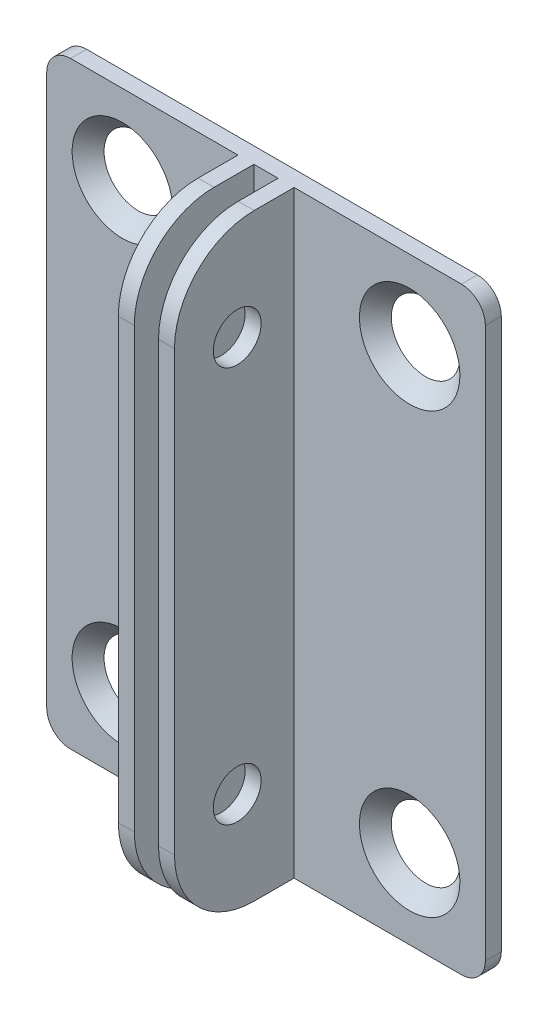
ISO-10303-21;
HEADER;
FILE_DESCRIPTION(('STEP AP214'),'2;1');
FILE_NAME('part.step','',(''),(''),'','','');
FILE_SCHEMA(('AUTOMOTIVE_DESIGN { 1 0 10303 214 1 1 1 1 }'));
ENDSEC;
DATA;
#1=APPLICATION_CONTEXT('core data for automotive mechanical design processes');
#2=APPLICATION_PROTOCOL_DEFINITION('international standard','automotive_design',2000,#1);
#3=PRODUCT_CONTEXT('',#1,'mechanical');
#4=PRODUCT('Part','Part','',(#3));
#5=PRODUCT_RELATED_PRODUCT_CATEGORY('part','',(#4));
#6=PRODUCT_DEFINITION_FORMATION('','',#4);
#7=PRODUCT_DEFINITION_CONTEXT('part definition',#1,'design');
#8=PRODUCT_DEFINITION('design','',#6,#7);
#9=PRODUCT_DEFINITION_SHAPE('','',#8);
#10=(LENGTH_UNIT() NAMED_UNIT(*) SI_UNIT(.MILLI.,.METRE.));
#11=(NAMED_UNIT(*) PLANE_ANGLE_UNIT() SI_UNIT($,.RADIAN.));
#12=(NAMED_UNIT(*) SI_UNIT($,.STERADIAN.) SOLID_ANGLE_UNIT());
#13=UNCERTAINTY_MEASURE_WITH_UNIT(LENGTH_MEASURE(1.E-05),#10,'distance_accuracy_value','');
#14=(GEOMETRIC_REPRESENTATION_CONTEXT(3) GLOBAL_UNCERTAINTY_ASSIGNED_CONTEXT((#13)) GLOBAL_UNIT_ASSIGNED_CONTEXT((#10,
#11,#12)) REPRESENTATION_CONTEXT('',''));
#15=CARTESIAN_POINT('',(0.,0.,0.));
#16=DIRECTION('',(0.,0.,1.));
#17=DIRECTION('',(1.,0.,0.));
#18=AXIS2_PLACEMENT_3D('',#15,#16,#17);
#19=CARTESIAN_POINT('',(0.,0.,0.));
#20=DIRECTION('',(0.,0.,-1.));
#21=DIRECTION('',(-1.,0.,0.));
#22=AXIS2_PLACEMENT_3D('',#19,#20,#21);
#23=PLANE('',#22);
#24=CARTESIAN_POINT('',(9.48839374827515,65.,0.));
#25=DIRECTION('',(0.,0.,-1.));
#26=DIRECTION('',(-1.,0.,0.));
#27=AXIS2_PLACEMENT_3D('',#24,#25,#26);
#28=CIRCLE('',#27,4.3);
#29=CARTESIAN_POINT('',(5.18839374827515,65.,0.));
#30=VERTEX_POINT('',#29);
#31=EDGE_CURVE('E287',#30,#30,#28,.T.);
#32=ORIENTED_EDGE('',*,*,#31,.F.);
#33=EDGE_LOOP('',(#32));
#34=FACE_BOUND('',#33,.T.);
#35=CARTESIAN_POINT('',(45.5116062517248,10.,0.));
#36=DIRECTION('',(0.,0.,-1.));
#37=DIRECTION('',(-1.,0.,0.));
#38=AXIS2_PLACEMENT_3D('',#35,#36,#37);
#39=CIRCLE('',#38,4.3);
#40=CARTESIAN_POINT('',(41.2116062517248,10.,0.));
#41=VERTEX_POINT('',#40);
#42=EDGE_CURVE('E283',#41,#41,#39,.T.);
#43=ORIENTED_EDGE('',*,*,#42,.F.);
#44=EDGE_LOOP('',(#43));
#45=FACE_BOUND('',#44,.T.);
#46=CARTESIAN_POINT('',(45.5116062517248,65.,0.));
#47=DIRECTION('',(0.,0.,-1.));
#48=DIRECTION('',(-1.,0.,0.));
#49=AXIS2_PLACEMENT_3D('',#46,#47,#48);
#50=CIRCLE('',#49,4.3);
#51=CARTESIAN_POINT('',(41.2116062517248,65.,0.));
#52=VERTEX_POINT('',#51);
#53=EDGE_CURVE('E236',#52,#52,#50,.T.);
#54=ORIENTED_EDGE('',*,*,#53,.F.);
#55=EDGE_LOOP('',(#54));
#56=FACE_BOUND('',#55,.T.);
#57=DIRECTION('',(0.,1.,0.));
#58=VECTOR('',#57,1.);
#59=CARTESIAN_POINT('',(55.,0.,0.));
#60=LINE('',#59,#58);
#61=CARTESIAN_POINT('',(55.,3.,0.));
#62=VERTEX_POINT('',#61);
#63=CARTESIAN_POINT('',(55.,72.,0.));
#64=VERTEX_POINT('',#63);
#65=EDGE_CURVE('E362',#62,#64,#60,.T.);
#66=ORIENTED_EDGE('',*,*,#65,.F.);
#67=CARTESIAN_POINT('',(52.,3.,0.));
#68=DIRECTION('',(0.,0.,-1.));
#69=DIRECTION('',(-1.,0.,0.));
#70=AXIS2_PLACEMENT_3D('',#67,#68,#69);
#71=CIRCLE('',#70,3.);
#72=CARTESIAN_POINT('',(52.,0.,0.));
#73=VERTEX_POINT('',#72);
#74=EDGE_CURVE('E289',#62,#73,#71,.T.);
#75=ORIENTED_EDGE('',*,*,#74,.T.);
#76=DIRECTION('',(1.,0.,0.));
#77=VECTOR('',#76,1.);
#78=CARTESIAN_POINT('',(0.,0.,0.));
#79=LINE('',#78,#77);
#80=CARTESIAN_POINT('',(3.,0.,0.));
#81=VERTEX_POINT('',#80);
#82=EDGE_CURVE('E358',#81,#73,#79,.T.);
#83=ORIENTED_EDGE('',*,*,#82,.F.);
#84=CARTESIAN_POINT('',(3.,3.,0.));
#85=DIRECTION('',(0.,0.,-1.));
#86=DIRECTION('',(-1.,0.,0.));
#87=AXIS2_PLACEMENT_3D('',#84,#85,#86);
#88=CIRCLE('',#87,3.);
#89=CARTESIAN_POINT('',(0.,3.,0.));
#90=VERTEX_POINT('',#89);
#91=EDGE_CURVE('E371',#81,#90,#88,.T.);
#92=ORIENTED_EDGE('',*,*,#91,.T.);
#93=DIRECTION('',(0.,-1.,0.));
#94=VECTOR('',#93,1.);
#95=CARTESIAN_POINT('',(0.,0.,0.));
#96=LINE('',#95,#94);
#97=CARTESIAN_POINT('',(0.,72.,0.));
#98=VERTEX_POINT('',#97);
#99=EDGE_CURVE('E228',#98,#90,#96,.T.);
#100=ORIENTED_EDGE('',*,*,#99,.F.);
#101=CARTESIAN_POINT('',(3.,72.,0.));
#102=DIRECTION('',(0.,0.,-1.));
#103=DIRECTION('',(-1.,0.,0.));
#104=AXIS2_PLACEMENT_3D('',#101,#102,#103);
#105=CIRCLE('',#104,3.);
#106=CARTESIAN_POINT('',(3.,75.,0.));
#107=VERTEX_POINT('',#106);
#108=EDGE_CURVE('E369',#98,#107,#105,.T.);
#109=ORIENTED_EDGE('',*,*,#108,.T.);
#110=DIRECTION('',(-1.,0.,0.));
#111=VECTOR('',#110,1.);
#112=CARTESIAN_POINT('',(0.,75.,0.));
#113=LINE('',#112,#111);
#114=CARTESIAN_POINT('',(52.,75.,0.));
#115=VERTEX_POINT('',#114);
#116=EDGE_CURVE('E214',#115,#107,#113,.T.);
#117=ORIENTED_EDGE('',*,*,#116,.F.);
#118=CARTESIAN_POINT('',(52.,72.,0.));
#119=DIRECTION('',(0.,0.,-1.));
#120=DIRECTION('',(-1.,0.,0.));
#121=AXIS2_PLACEMENT_3D('',#118,#119,#120);
#122=CIRCLE('',#121,3.);
#123=EDGE_CURVE('E213',#115,#64,#122,.T.);
#124=ORIENTED_EDGE('',*,*,#123,.T.);
#125=EDGE_LOOP('',(#66,#75,#83,#92,#100,#109,#117,#124));
#126=FACE_BOUND('',#125,.T.);
#127=CARTESIAN_POINT('',(9.48839374827515,9.99999999999999,0.));
#128=DIRECTION('',(0.,0.,-1.));
#129=DIRECTION('',(-1.,0.,0.));
#130=AXIS2_PLACEMENT_3D('',#127,#128,#129);
#131=CIRCLE('',#130,4.3);
#132=CARTESIAN_POINT('',(5.18839374827515,9.99999999999999,0.));
#133=VERTEX_POINT('',#132);
#134=EDGE_CURVE('E43',#133,#133,#131,.T.);
#135=ORIENTED_EDGE('',*,*,#134,.F.);
#136=EDGE_LOOP('',(#135));
#137=FACE_BOUND('',#136,.T.);
#138=ADVANCED_FACE('F34',(#34,#45,#56,#126,#137),#23,.T.);
#139=CARTESIAN_POINT('',(0.,0.,2.));
#140=DIRECTION('',(0.,0.,-1.));
#141=DIRECTION('',(-1.,0.,0.));
#142=AXIS2_PLACEMENT_3D('',#139,#140,#141);
#143=PLANE('',#142);
#144=CARTESIAN_POINT('',(9.48839374827515,9.99999999999999,2.));
#145=DIRECTION('',(0.,0.,1.));
#146=DIRECTION('',(1.,0.,0.));
#147=AXIS2_PLACEMENT_3D('',#144,#145,#146);
#148=CIRCLE('',#147,6.3);
#149=CARTESIAN_POINT('',(15.7883937482752,9.99999999999999,2.));
#150=VERTEX_POINT('',#149);
#151=EDGE_CURVE('E11',#150,#150,#148,.T.);
#152=ORIENTED_EDGE('',*,*,#151,.F.);
#153=EDGE_LOOP('',(#152));
#154=FACE_BOUND('',#153,.T.);
#155=DIRECTION('',(0.,-1.,0.));
#156=VECTOR('',#155,1.);
#157=CARTESIAN_POINT('',(0.,0.,2.));
#158=LINE('',#157,#156);
#159=CARTESIAN_POINT('',(0.,72.,2.));
#160=VERTEX_POINT('',#159);
#161=CARTESIAN_POINT('',(0.,3.,2.));
#162=VERTEX_POINT('',#161);
#163=EDGE_CURVE('E208',#160,#162,#158,.T.);
#164=ORIENTED_EDGE('',*,*,#163,.T.);
#165=CARTESIAN_POINT('',(3.,3.,2.));
#166=DIRECTION('',(0.,0.,-1.));
#167=DIRECTION('',(-1.,0.,0.));
#168=AXIS2_PLACEMENT_3D('',#165,#166,#167);
#169=CIRCLE('',#168,3.);
#170=CARTESIAN_POINT('',(3.,0.,2.));
#171=VERTEX_POINT('',#170);
#172=EDGE_CURVE('E181',#162,#171,#169,.F.);
#173=ORIENTED_EDGE('',*,*,#172,.T.);
#174=DIRECTION('',(1.,0.,0.));
#175=VECTOR('',#174,1.);
#176=CARTESIAN_POINT('',(0.,0.,2.));
#177=LINE('',#176,#175);
#178=CARTESIAN_POINT('',(23.9815017817718,0.,2.));
#179=VERTEX_POINT('',#178);
#180=EDGE_CURVE('E232',#171,#179,#177,.T.);
#181=ORIENTED_EDGE('',*,*,#180,.T.);
#182=DIRECTION('',(0.,-1.,0.));
#183=VECTOR('',#182,1.);
#184=CARTESIAN_POINT('',(23.9815017817718,0.,2.));
#185=LINE('',#184,#183);
#186=CARTESIAN_POINT('',(23.9815017817718,75.,2.));
#187=VERTEX_POINT('',#186);
#188=EDGE_CURVE('E271',#187,#179,#185,.T.);
#189=ORIENTED_EDGE('',*,*,#188,.F.);
#190=DIRECTION('',(-1.,0.,0.));
#191=VECTOR('',#190,1.);
#192=CARTESIAN_POINT('',(0.,75.,2.));
#193=LINE('',#192,#191);
#194=CARTESIAN_POINT('',(3.,75.,2.));
#195=VERTEX_POINT('',#194);
#196=EDGE_CURVE('E211',#187,#195,#193,.T.);
#197=ORIENTED_EDGE('',*,*,#196,.T.);
#198=CARTESIAN_POINT('',(3.,72.,2.));
#199=DIRECTION('',(0.,0.,-1.));
#200=DIRECTION('',(-1.,0.,0.));
#201=AXIS2_PLACEMENT_3D('',#198,#199,#200);
#202=CIRCLE('',#201,3.);
#203=EDGE_CURVE('E229',#195,#160,#202,.F.);
#204=ORIENTED_EDGE('',*,*,#203,.T.);
#205=EDGE_LOOP('',(#164,#173,#181,#189,#197,#204));
#206=FACE_BOUND('',#205,.T.);
#207=CARTESIAN_POINT('',(9.48839374827515,65.,2.));
#208=DIRECTION('',(0.,0.,1.));
#209=DIRECTION('',(1.,0.,0.));
#210=AXIS2_PLACEMENT_3D('',#207,#208,#209);
#211=CIRCLE('',#210,6.3);
#212=CARTESIAN_POINT('',(15.7883937482752,65.,2.));
#213=VERTEX_POINT('',#212);
#214=EDGE_CURVE('E290',#213,#213,#211,.T.);
#215=ORIENTED_EDGE('',*,*,#214,.F.);
#216=EDGE_LOOP('',(#215));
#217=FACE_BOUND('',#216,.T.);
#218=ADVANCED_FACE('F386',(#154,#206,#217),#143,.F.);
#219=DIRECTION('',(0.,-1.,0.));
#220=VECTOR('',#219,1.);
#221=CARTESIAN_POINT('',(29.0161196164076,0.,2.));
#222=LINE('',#221,#220);
#223=CARTESIAN_POINT('',(29.0161196164075,75.,2.));
#224=VERTEX_POINT('',#223);
#225=CARTESIAN_POINT('',(29.0161196164075,0.,2.));
#226=VERTEX_POINT('',#225);
#227=EDGE_CURVE('E248',#224,#226,#222,.T.);
#228=ORIENTED_EDGE('',*,*,#227,.F.);
#229=CARTESIAN_POINT('',(25.9838803835925,75.,2.));
#230=VERTEX_POINT('',#229);
#231=EDGE_CURVE('E210',#224,#230,#193,.T.);
#232=ORIENTED_EDGE('',*,*,#231,.T.);
#233=DIRECTION('',(0.,1.,0.));
#234=VECTOR('',#233,1.);
#235=CARTESIAN_POINT('',(25.9838803835925,0.,2.));
#236=LINE('',#235,#234);
#237=CARTESIAN_POINT('',(25.9838803835925,0.,2.));
#238=VERTEX_POINT('',#237);
#239=EDGE_CURVE('E267',#238,#230,#236,.T.);
#240=ORIENTED_EDGE('',*,*,#239,.F.);
#241=EDGE_CURVE('E353',#238,#226,#177,.T.);
#242=ORIENTED_EDGE('',*,*,#241,.T.);
#243=EDGE_LOOP('',(#228,#232,#240,#242));
#244=FACE_BOUND('',#243,.T.);
#245=ADVANCED_FACE('F458',(#244),#143,.F.);
#246=CARTESIAN_POINT('',(45.5116062517248,10.,2.));
#247=DIRECTION('',(0.,0.,1.));
#248=DIRECTION('',(1.,0.,0.));
#249=AXIS2_PLACEMENT_3D('',#246,#247,#248);
#250=CIRCLE('',#249,6.3);
#251=CARTESIAN_POINT('',(51.8116062517248,10.,2.));
#252=VERTEX_POINT('',#251);
#253=EDGE_CURVE('E285',#252,#252,#250,.T.);
#254=ORIENTED_EDGE('',*,*,#253,.F.);
#255=EDGE_LOOP('',(#254));
#256=FACE_BOUND('',#255,.T.);
#257=CARTESIAN_POINT('',(45.5116062517248,65.,2.));
#258=DIRECTION('',(0.,0.,1.));
#259=DIRECTION('',(1.,0.,0.));
#260=AXIS2_PLACEMENT_3D('',#257,#258,#259);
#261=CIRCLE('',#260,6.3);
#262=CARTESIAN_POINT('',(51.8116062517248,65.,2.));
#263=VERTEX_POINT('',#262);
#264=EDGE_CURVE('E282',#263,#263,#261,.T.);
#265=ORIENTED_EDGE('',*,*,#264,.F.);
#266=EDGE_LOOP('',(#265));
#267=FACE_BOUND('',#266,.T.);
#268=CARTESIAN_POINT('',(31.0184982182283,0.,2.));
#269=VERTEX_POINT('',#268);
#270=CARTESIAN_POINT('',(52.,0.,2.));
#271=VERTEX_POINT('',#270);
#272=EDGE_CURVE('E352',#269,#271,#177,.T.);
#273=ORIENTED_EDGE('',*,*,#272,.T.);
#274=CARTESIAN_POINT('',(52.,3.,2.));
#275=DIRECTION('',(0.,0.,-1.));
#276=DIRECTION('',(-1.,0.,0.));
#277=AXIS2_PLACEMENT_3D('',#274,#275,#276);
#278=CIRCLE('',#277,3.);
#279=CARTESIAN_POINT('',(55.,3.,2.));
#280=VERTEX_POINT('',#279);
#281=EDGE_CURVE('E354',#271,#280,#278,.F.);
#282=ORIENTED_EDGE('',*,*,#281,.T.);
#283=DIRECTION('',(0.,1.,0.));
#284=VECTOR('',#283,1.);
#285=CARTESIAN_POINT('',(55.,0.,2.));
#286=LINE('',#285,#284);
#287=CARTESIAN_POINT('',(55.,72.,2.));
#288=VERTEX_POINT('',#287);
#289=EDGE_CURVE('E196',#280,#288,#286,.T.);
#290=ORIENTED_EDGE('',*,*,#289,.T.);
#291=CARTESIAN_POINT('',(52.,72.,2.));
#292=DIRECTION('',(0.,0.,-1.));
#293=DIRECTION('',(-1.,0.,0.));
#294=AXIS2_PLACEMENT_3D('',#291,#292,#293);
#295=CIRCLE('',#294,3.);
#296=CARTESIAN_POINT('',(52.,75.,2.));
#297=VERTEX_POINT('',#296);
#298=EDGE_CURVE('E188',#288,#297,#295,.F.);
#299=ORIENTED_EDGE('',*,*,#298,.T.);
#300=CARTESIAN_POINT('',(31.0184982182283,75.,2.));
#301=VERTEX_POINT('',#300);
#302=EDGE_CURVE('E193',#297,#301,#193,.T.);
#303=ORIENTED_EDGE('',*,*,#302,.T.);
#304=DIRECTION('',(0.,1.,0.));
#305=VECTOR('',#304,1.);
#306=CARTESIAN_POINT('',(31.0184982182283,0.,2.));
#307=LINE('',#306,#305);
#308=EDGE_CURVE('E244',#269,#301,#307,.T.);
#309=ORIENTED_EDGE('',*,*,#308,.F.);
#310=EDGE_LOOP('',(#273,#282,#290,#299,#303,#309));
#311=FACE_BOUND('',#310,.T.);
#312=ADVANCED_FACE('F191',(#256,#267,#311),#143,.F.);
#313=CARTESIAN_POINT('',(0.,0.,2.));
#314=DIRECTION('',(1.,0.,0.));
#315=DIRECTION('',(0.,0.,-1.));
#316=AXIS2_PLACEMENT_3D('',#313,#314,#315);
#317=PLANE('',#316);
#318=ORIENTED_EDGE('',*,*,#99,.T.);
#319=DIRECTION('',(0.,0.,-1.));
#320=VECTOR('',#319,1.);
#321=CARTESIAN_POINT('',(0.,3.,2.));
#322=LINE('',#321,#320);
#323=EDGE_CURVE('E226',#90,#162,#322,.F.);
#324=ORIENTED_EDGE('',*,*,#323,.T.);
#325=ORIENTED_EDGE('',*,*,#163,.F.);
#326=DIRECTION('',(0.,0.,-1.));
#327=VECTOR('',#326,1.);
#328=CARTESIAN_POINT('',(0.,72.,2.));
#329=LINE('',#328,#327);
#330=EDGE_CURVE('E222',#160,#98,#329,.T.);
#331=ORIENTED_EDGE('',*,*,#330,.T.);
#332=EDGE_LOOP('',(#318,#324,#325,#331));
#333=FACE_BOUND('',#332,.T.);
#334=ADVANCED_FACE('F394',(#333),#317,.F.);
#335=CARTESIAN_POINT('',(0.,0.,2.));
#336=DIRECTION('',(0.,1.,0.));
#337=DIRECTION('',(0.,0.,1.));
#338=AXIS2_PLACEMENT_3D('',#335,#336,#337);
#339=PLANE('',#338);
#340=DIRECTION('',(0.,0.,-1.));
#341=VECTOR('',#340,1.);
#342=CARTESIAN_POINT('',(31.0184982182283,0.,17.));
#343=LINE('',#342,#341);
#344=CARTESIAN_POINT('',(31.0184982182283,0.,7.));
#345=VERTEX_POINT('',#344);
#346=EDGE_CURVE('E247',#345,#269,#343,.T.);
#347=ORIENTED_EDGE('',*,*,#346,.F.);
#348=DIRECTION('',(1.,0.,0.));
#349=VECTOR('',#348,1.);
#350=CARTESIAN_POINT('',(0.,0.,7.));
#351=LINE('',#350,#349);
#352=CARTESIAN_POINT('',(29.0161196164076,0.,7.));
#353=VERTEX_POINT('',#352);
#354=EDGE_CURVE('E225',#345,#353,#351,.F.);
#355=ORIENTED_EDGE('',*,*,#354,.T.);
#356=DIRECTION('',(0.,0.,-1.));
#357=VECTOR('',#356,1.);
#358=CARTESIAN_POINT('',(29.0161196164076,0.,17.));
#359=LINE('',#358,#357);
#360=EDGE_CURVE('E142',#353,#226,#359,.T.);
#361=ORIENTED_EDGE('',*,*,#360,.T.);
#362=ORIENTED_EDGE('',*,*,#241,.F.);
#363=DIRECTION('',(0.,0.,-1.));
#364=VECTOR('',#363,1.);
#365=CARTESIAN_POINT('',(25.9838803835925,0.,17.));
#366=LINE('',#365,#364);
#367=CARTESIAN_POINT('',(25.9838803835925,0.,7.));
#368=VERTEX_POINT('',#367);
#369=EDGE_CURVE('E270',#368,#238,#366,.T.);
#370=ORIENTED_EDGE('',*,*,#369,.F.);
#371=DIRECTION('',(1.,0.,0.));
#372=VECTOR('',#371,1.);
#373=CARTESIAN_POINT('',(0.,0.,7.));
#374=LINE('',#373,#372);
#375=CARTESIAN_POINT('',(23.9815017817718,0.,7.));
#376=VERTEX_POINT('',#375);
#377=EDGE_CURVE('E134',#368,#376,#374,.F.);
#378=ORIENTED_EDGE('',*,*,#377,.T.);
#379=DIRECTION('',(0.,0.,-1.));
#380=VECTOR('',#379,1.);
#381=CARTESIAN_POINT('',(23.9815017817718,0.,17.));
#382=LINE('',#381,#380);
#383=EDGE_CURVE('E250',#376,#179,#382,.T.);
#384=ORIENTED_EDGE('',*,*,#383,.T.);
#385=ORIENTED_EDGE('',*,*,#180,.F.);
#386=DIRECTION('',(0.,0.,-1.));
#387=VECTOR('',#386,1.);
#388=CARTESIAN_POINT('',(3.,0.,2.));
#389=LINE('',#388,#387);
#390=EDGE_CURVE('E347',#171,#81,#389,.T.);
#391=ORIENTED_EDGE('',*,*,#390,.T.);
#392=ORIENTED_EDGE('',*,*,#82,.T.);
#393=DIRECTION('',(0.,0.,-1.));
#394=VECTOR('',#393,1.);
#395=CARTESIAN_POINT('',(52.,0.,2.));
#396=LINE('',#395,#394);
#397=EDGE_CURVE('E361',#73,#271,#396,.F.);
#398=ORIENTED_EDGE('',*,*,#397,.T.);
#399=ORIENTED_EDGE('',*,*,#272,.F.);
#400=EDGE_LOOP('',(#347,#355,#361,#362,#370,#378,#384,#385,#391,#392,#398,#399));
#401=FACE_BOUND('',#400,.T.);
#402=ADVANCED_FACE('F404',(#401),#339,.F.);
#403=CARTESIAN_POINT('',(55.,0.,2.));
#404=DIRECTION('',(-1.,0.,0.));
#405=DIRECTION('',(0.,0.,1.));
#406=AXIS2_PLACEMENT_3D('',#403,#404,#405);
#407=PLANE('',#406);
#408=ORIENTED_EDGE('',*,*,#289,.F.);
#409=DIRECTION('',(0.,0.,-1.));
#410=VECTOR('',#409,1.);
#411=CARTESIAN_POINT('',(55.,3.,2.));
#412=LINE('',#411,#410);
#413=EDGE_CURVE('E364',#280,#62,#412,.T.);
#414=ORIENTED_EDGE('',*,*,#413,.T.);
#415=ORIENTED_EDGE('',*,*,#65,.T.);
#416=DIRECTION('',(0.,0.,-1.));
#417=VECTOR('',#416,1.);
#418=CARTESIAN_POINT('',(55.,72.,2.));
#419=LINE('',#418,#417);
#420=EDGE_CURVE('E279',#64,#288,#419,.F.);
#421=ORIENTED_EDGE('',*,*,#420,.T.);
#422=EDGE_LOOP('',(#408,#414,#415,#421));
#423=FACE_BOUND('',#422,.T.);
#424=ADVANCED_FACE('F444',(#423),#407,.F.);
#425=CARTESIAN_POINT('',(0.,75.,2.));
#426=DIRECTION('',(0.,-1.,0.));
#427=DIRECTION('',(0.,0.,-1.));
#428=AXIS2_PLACEMENT_3D('',#425,#426,#427);
#429=PLANE('',#428);
#430=DIRECTION('',(0.,0.,-1.));
#431=VECTOR('',#430,1.);
#432=CARTESIAN_POINT('',(29.0161196164075,75.,17.));
#433=LINE('',#432,#431);
#434=CARTESIAN_POINT('',(29.0161196164075,75.,7.));
#435=VERTEX_POINT('',#434);
#436=EDGE_CURVE('E255',#435,#224,#433,.T.);
#437=ORIENTED_EDGE('',*,*,#436,.F.);
#438=DIRECTION('',(-1.,0.,0.));
#439=VECTOR('',#438,1.);
#440=CARTESIAN_POINT('',(0.,75.,7.));
#441=LINE('',#440,#439);
#442=CARTESIAN_POINT('',(31.0184982182282,75.,7.));
#443=VERTEX_POINT('',#442);
#444=EDGE_CURVE('E217',#435,#443,#441,.F.);
#445=ORIENTED_EDGE('',*,*,#444,.T.);
#446=DIRECTION('',(0.,0.,-1.));
#447=VECTOR('',#446,1.);
#448=CARTESIAN_POINT('',(31.0184982182282,75.,17.));
#449=LINE('',#448,#447);
#450=EDGE_CURVE('E207',#443,#301,#449,.T.);
#451=ORIENTED_EDGE('',*,*,#450,.T.);
#452=ORIENTED_EDGE('',*,*,#302,.F.);
#453=DIRECTION('',(0.,0.,-1.));
#454=VECTOR('',#453,1.);
#455=CARTESIAN_POINT('',(52.,75.,2.));
#456=LINE('',#455,#454);
#457=EDGE_CURVE('E204',#297,#115,#456,.T.);
#458=ORIENTED_EDGE('',*,*,#457,.T.);
#459=ORIENTED_EDGE('',*,*,#116,.T.);
#460=DIRECTION('',(0.,0.,-1.));
#461=VECTOR('',#460,1.);
#462=CARTESIAN_POINT('',(3.,75.,2.));
#463=LINE('',#462,#461);
#464=EDGE_CURVE('E87',#107,#195,#463,.F.);
#465=ORIENTED_EDGE('',*,*,#464,.T.);
#466=ORIENTED_EDGE('',*,*,#196,.F.);
#467=DIRECTION('',(0.,0.,-1.));
#468=VECTOR('',#467,1.);
#469=CARTESIAN_POINT('',(23.9815017817718,75.,17.));
#470=LINE('',#469,#468);
#471=CARTESIAN_POINT('',(23.9815017817718,75.,7.));
#472=VERTEX_POINT('',#471);
#473=EDGE_CURVE('E273',#472,#187,#470,.T.);
#474=ORIENTED_EDGE('',*,*,#473,.F.);
#475=DIRECTION('',(-1.,0.,0.));
#476=VECTOR('',#475,1.);
#477=CARTESIAN_POINT('',(0.,75.,7.));
#478=LINE('',#477,#476);
#479=CARTESIAN_POINT('',(25.9838803835925,75.,7.));
#480=VERTEX_POINT('',#479);
#481=EDGE_CURVE('E78',#472,#480,#478,.F.);
#482=ORIENTED_EDGE('',*,*,#481,.T.);
#483=DIRECTION('',(0.,0.,-1.));
#484=VECTOR('',#483,1.);
#485=CARTESIAN_POINT('',(25.9838803835925,75.,17.));
#486=LINE('',#485,#484);
#487=EDGE_CURVE('E276',#480,#230,#486,.T.);
#488=ORIENTED_EDGE('',*,*,#487,.T.);
#489=ORIENTED_EDGE('',*,*,#231,.F.);
#490=EDGE_LOOP('',(#437,#445,#451,#452,#458,#459,#465,#466,#474,#482,#488,#489));
#491=FACE_BOUND('',#490,.T.);
#492=ADVANCED_FACE('F203',(#491),#429,.F.);
#493=CARTESIAN_POINT('',(23.9815017817718,0.,17.));
#494=DIRECTION('',(1.,0.,0.));
#495=DIRECTION('',(0.,0.,-1.));
#496=AXIS2_PLACEMENT_3D('',#493,#494,#495);
#497=PLANE('',#496);
#498=CARTESIAN_POINT('',(23.9815017817718,62.3122140243295,9.1337107707589));
#499=DIRECTION('',(1.,0.,0.));
#500=DIRECTION('',(0.,0.,-1.));
#501=AXIS2_PLACEMENT_3D('',#498,#499,#500);
#502=CIRCLE('',#501,3.);
#503=CARTESIAN_POINT('',(23.9815017817718,62.3122140243295,6.13371077075891));
#504=VERTEX_POINT('',#503);
#505=EDGE_CURVE('E313',#504,#504,#502,.F.);
#506=ORIENTED_EDGE('',*,*,#505,.F.);
#507=EDGE_LOOP('',(#506));
#508=FACE_BOUND('',#507,.T.);
#509=CARTESIAN_POINT('',(23.9815017817718,12.6877859756705,9.13371077075888));
#510=DIRECTION('',(1.,0.,0.));
#511=DIRECTION('',(0.,0.,-1.));
#512=AXIS2_PLACEMENT_3D('',#509,#510,#511);
#513=CIRCLE('',#512,3.);
#514=CARTESIAN_POINT('',(23.9815017817718,12.6877859756705,6.13371077075888));
#515=VERTEX_POINT('',#514);
#516=EDGE_CURVE('E302',#515,#515,#513,.F.);
#517=ORIENTED_EDGE('',*,*,#516,.F.);
#518=EDGE_LOOP('',(#517));
#519=FACE_BOUND('',#518,.T.);
#520=ORIENTED_EDGE('',*,*,#383,.F.);
#521=CARTESIAN_POINT('',(23.9815017817718,10.,7.));
#522=DIRECTION('',(1.,0.,0.));
#523=DIRECTION('',(0.,0.,-1.));
#524=AXIS2_PLACEMENT_3D('',#521,#522,#523);
#525=CIRCLE('',#524,10.);
#526=CARTESIAN_POINT('',(23.9815017817718,10.,17.));
#527=VERTEX_POINT('',#526);
#528=EDGE_CURVE('E274',#376,#527,#525,.F.);
#529=ORIENTED_EDGE('',*,*,#528,.T.);
#530=DIRECTION('',(0.,-1.,0.));
#531=VECTOR('',#530,1.);
#532=CARTESIAN_POINT('',(23.9815017817718,0.,17.));
#533=LINE('',#532,#531);
#534=CARTESIAN_POINT('',(23.9815017817718,65.,17.));
#535=VERTEX_POINT('',#534);
#536=EDGE_CURVE('E264',#535,#527,#533,.T.);
#537=ORIENTED_EDGE('',*,*,#536,.F.);
#538=CARTESIAN_POINT('',(23.9815017817718,65.,7.));
#539=DIRECTION('',(1.,0.,0.));
#540=DIRECTION('',(0.,0.,-1.));
#541=AXIS2_PLACEMENT_3D('',#538,#539,#540);
#542=CIRCLE('',#541,10.);
#543=EDGE_CURVE('E52',#535,#472,#542,.F.);
#544=ORIENTED_EDGE('',*,*,#543,.T.);
#545=ORIENTED_EDGE('',*,*,#473,.T.);
#546=ORIENTED_EDGE('',*,*,#188,.T.);
#547=EDGE_LOOP('',(#520,#529,#537,#544,#545,#546));
#548=FACE_BOUND('',#547,.T.);
#549=ADVANCED_FACE('F407',(#508,#519,#548),#497,.F.);
#550=CARTESIAN_POINT('',(25.9838803835925,0.,17.));
#551=DIRECTION('',(-1.,0.,0.));
#552=DIRECTION('',(0.,0.,1.));
#553=AXIS2_PLACEMENT_3D('',#550,#551,#552);
#554=PLANE('',#553);
#555=CARTESIAN_POINT('',(25.9838803835925,62.3122140243295,9.1337107707589));
#556=DIRECTION('',(-1.,0.,0.));
#557=DIRECTION('',(0.,0.,1.));
#558=AXIS2_PLACEMENT_3D('',#555,#556,#557);
#559=CIRCLE('',#558,3.);
#560=CARTESIAN_POINT('',(25.9838803835925,62.3122140243295,12.1337107707589));
#561=VERTEX_POINT('',#560);
#562=EDGE_CURVE('E310',#561,#561,#559,.F.);
#563=ORIENTED_EDGE('',*,*,#562,.F.);
#564=EDGE_LOOP('',(#563));
#565=FACE_BOUND('',#564,.T.);
#566=CARTESIAN_POINT('',(25.9838803835925,12.6877859756705,9.13371077075888));
#567=DIRECTION('',(-1.,0.,0.));
#568=DIRECTION('',(0.,0.,1.));
#569=AXIS2_PLACEMENT_3D('',#566,#567,#568);
#570=CIRCLE('',#569,3.);
#571=CARTESIAN_POINT('',(25.9838803835925,12.6877859756705,12.1337107707589));
#572=VERTEX_POINT('',#571);
#573=EDGE_CURVE('E297',#572,#572,#570,.F.);
#574=ORIENTED_EDGE('',*,*,#573,.F.);
#575=EDGE_LOOP('',(#574));
#576=FACE_BOUND('',#575,.T.);
#577=DIRECTION('',(0.,1.,0.));
#578=VECTOR('',#577,1.);
#579=CARTESIAN_POINT('',(25.9838803835925,0.,17.));
#580=LINE('',#579,#578);
#581=CARTESIAN_POINT('',(25.9838803835925,10.,17.));
#582=VERTEX_POINT('',#581);
#583=CARTESIAN_POINT('',(25.9838803835925,65.,17.));
#584=VERTEX_POINT('',#583);
#585=EDGE_CURVE('E260',#582,#584,#580,.T.);
#586=ORIENTED_EDGE('',*,*,#585,.F.);
#587=CARTESIAN_POINT('',(25.9838803835925,10.,7.));
#588=DIRECTION('',(-1.,0.,0.));
#589=DIRECTION('',(0.,0.,1.));
#590=AXIS2_PLACEMENT_3D('',#587,#588,#589);
#591=CIRCLE('',#590,10.);
#592=EDGE_CURVE('E268',#582,#368,#591,.F.);
#593=ORIENTED_EDGE('',*,*,#592,.T.);
#594=ORIENTED_EDGE('',*,*,#369,.T.);
#595=ORIENTED_EDGE('',*,*,#239,.T.);
#596=ORIENTED_EDGE('',*,*,#487,.F.);
#597=CARTESIAN_POINT('',(25.9838803835925,65.,7.));
#598=DIRECTION('',(-1.,0.,0.));
#599=DIRECTION('',(0.,0.,1.));
#600=AXIS2_PLACEMENT_3D('',#597,#598,#599);
#601=CIRCLE('',#600,10.);
#602=EDGE_CURVE('E265',#480,#584,#601,.F.);
#603=ORIENTED_EDGE('',*,*,#602,.T.);
#604=EDGE_LOOP('',(#586,#593,#594,#595,#596,#603));
#605=FACE_BOUND('',#604,.T.);
#606=ADVANCED_FACE('F414',(#565,#576,#605),#554,.F.);
#607=CARTESIAN_POINT('',(0.,0.,17.));
#608=DIRECTION('',(0.,0.,-1.));
#609=DIRECTION('',(-1.,0.,0.));
#610=AXIS2_PLACEMENT_3D('',#607,#608,#609);
#611=PLANE('',#610);
#612=ORIENTED_EDGE('',*,*,#536,.T.);
#613=DIRECTION('',(1.,0.,0.));
#614=VECTOR('',#613,1.);
#615=CARTESIAN_POINT('',(0.,10.,17.));
#616=LINE('',#615,#614);
#617=EDGE_CURVE('E261',#527,#582,#616,.T.);
#618=ORIENTED_EDGE('',*,*,#617,.T.);
#619=ORIENTED_EDGE('',*,*,#585,.T.);
#620=DIRECTION('',(-1.,0.,0.));
#621=VECTOR('',#620,1.);
#622=CARTESIAN_POINT('',(0.,65.,17.));
#623=LINE('',#622,#621);
#624=EDGE_CURVE('E258',#584,#535,#623,.T.);
#625=ORIENTED_EDGE('',*,*,#624,.T.);
#626=EDGE_LOOP('',(#612,#618,#619,#625));
#627=FACE_BOUND('',#626,.T.);
#628=ADVANCED_FACE('F416',(#627),#611,.F.);
#629=CARTESIAN_POINT('',(29.0161196164076,0.,17.));
#630=DIRECTION('',(1.,0.,0.));
#631=DIRECTION('',(0.,1.,0.));
#632=AXIS2_PLACEMENT_3D('',#629,#630,#631);
#633=PLANE('',#632);
#634=CARTESIAN_POINT('',(29.0161196164075,62.3122140243295,9.1337107707589));
#635=DIRECTION('',(1.,0.,0.));
#636=DIRECTION('',(0.,1.,0.));
#637=AXIS2_PLACEMENT_3D('',#634,#635,#636);
#638=CIRCLE('',#637,3.);
#639=CARTESIAN_POINT('',(29.0161196164075,65.3122140243295,9.1337107707589));
#640=VERTEX_POINT('',#639);
#641=EDGE_CURVE('E307',#640,#640,#638,.F.);
#642=ORIENTED_EDGE('',*,*,#641,.F.);
#643=EDGE_LOOP('',(#642));
#644=FACE_BOUND('',#643,.T.);
#645=CARTESIAN_POINT('',(29.0161196164076,12.6877859756705,9.13371077075888));
#646=DIRECTION('',(1.,0.,0.));
#647=DIRECTION('',(0.,1.,0.));
#648=AXIS2_PLACEMENT_3D('',#645,#646,#647);
#649=CIRCLE('',#648,3.);
#650=CARTESIAN_POINT('',(29.0161196164076,15.6877859756705,9.13371077075888));
#651=VERTEX_POINT('',#650);
#652=EDGE_CURVE('E293',#651,#651,#649,.F.);
#653=ORIENTED_EDGE('',*,*,#652,.F.);
#654=EDGE_LOOP('',(#653));
#655=FACE_BOUND('',#654,.T.);
#656=ORIENTED_EDGE('',*,*,#360,.F.);
#657=CARTESIAN_POINT('',(29.0161196164076,10.,7.));
#658=DIRECTION('',(1.,0.,0.));
#659=DIRECTION('',(0.,1.,0.));
#660=AXIS2_PLACEMENT_3D('',#657,#658,#659);
#661=CIRCLE('',#660,10.);
#662=CARTESIAN_POINT('',(29.0161196164076,10.,17.));
#663=VERTEX_POINT('',#662);
#664=EDGE_CURVE('E256',#353,#663,#661,.F.);
#665=ORIENTED_EDGE('',*,*,#664,.T.);
#666=DIRECTION('',(0.,-1.,0.));
#667=VECTOR('',#666,1.);
#668=CARTESIAN_POINT('',(29.0161196164076,0.,17.));
#669=LINE('',#668,#667);
#670=CARTESIAN_POINT('',(29.0161196164075,65.,17.));
#671=VERTEX_POINT('',#670);
#672=EDGE_CURVE('E241',#671,#663,#669,.T.);
#673=ORIENTED_EDGE('',*,*,#672,.F.);
#674=CARTESIAN_POINT('',(29.0161196164075,65.,7.));
#675=DIRECTION('',(1.,0.,0.));
#676=DIRECTION('',(0.,1.,0.));
#677=AXIS2_PLACEMENT_3D('',#674,#675,#676);
#678=CIRCLE('',#677,10.);
#679=EDGE_CURVE('E252',#671,#435,#678,.F.);
#680=ORIENTED_EDGE('',*,*,#679,.T.);
#681=ORIENTED_EDGE('',*,*,#436,.T.);
#682=ORIENTED_EDGE('',*,*,#227,.T.);
#683=EDGE_LOOP('',(#656,#665,#673,#680,#681,#682));
#684=FACE_BOUND('',#683,.T.);
#685=ADVANCED_FACE('F424',(#644,#655,#684),#633,.F.);
#686=CARTESIAN_POINT('',(31.0184982182283,0.,17.));
#687=DIRECTION('',(-1.,0.,0.));
#688=DIRECTION('',(0.,-1.,0.));
#689=AXIS2_PLACEMENT_3D('',#686,#687,#688);
#690=PLANE('',#689);
#691=CARTESIAN_POINT('',(31.0184982182282,62.3122140243295,9.1337107707589));
#692=DIRECTION('',(-1.,0.,0.));
#693=DIRECTION('',(0.,-1.,0.));
#694=AXIS2_PLACEMENT_3D('',#691,#692,#693);
#695=CIRCLE('',#694,3.);
#696=CARTESIAN_POINT('',(31.0184982182282,59.3122140243295,9.1337107707589));
#697=VERTEX_POINT('',#696);
#698=EDGE_CURVE('E37',#697,#697,#695,.F.);
#699=ORIENTED_EDGE('',*,*,#698,.F.);
#700=EDGE_LOOP('',(#699));
#701=FACE_BOUND('',#700,.T.);
#702=CARTESIAN_POINT('',(31.0184982182283,12.6877859756705,9.13371077075888));
#703=DIRECTION('',(-1.,0.,0.));
#704=DIRECTION('',(0.,-1.,0.));
#705=AXIS2_PLACEMENT_3D('',#702,#703,#704);
#706=CIRCLE('',#705,3.);
#707=CARTESIAN_POINT('',(31.0184982182283,9.68778597567051,9.13371077075888));
#708=VERTEX_POINT('',#707);
#709=EDGE_CURVE('E291',#708,#708,#706,.F.);
#710=ORIENTED_EDGE('',*,*,#709,.F.);
#711=EDGE_LOOP('',(#710));
#712=FACE_BOUND('',#711,.T.);
#713=DIRECTION('',(0.,1.,0.));
#714=VECTOR('',#713,1.);
#715=CARTESIAN_POINT('',(31.0184982182283,0.,17.));
#716=LINE('',#715,#714);
#717=CARTESIAN_POINT('',(31.0184982182283,10.,17.));
#718=VERTEX_POINT('',#717);
#719=CARTESIAN_POINT('',(31.0184982182282,65.,17.));
#720=VERTEX_POINT('',#719);
#721=EDGE_CURVE('E237',#718,#720,#716,.T.);
#722=ORIENTED_EDGE('',*,*,#721,.F.);
#723=CARTESIAN_POINT('',(31.0184982182283,10.,7.));
#724=DIRECTION('',(-1.,0.,0.));
#725=DIRECTION('',(0.,-1.,0.));
#726=AXIS2_PLACEMENT_3D('',#723,#724,#725);
#727=CIRCLE('',#726,10.);
#728=EDGE_CURVE('E245',#718,#345,#727,.F.);
#729=ORIENTED_EDGE('',*,*,#728,.T.);
#730=ORIENTED_EDGE('',*,*,#346,.T.);
#731=ORIENTED_EDGE('',*,*,#308,.T.);
#732=ORIENTED_EDGE('',*,*,#450,.F.);
#733=CARTESIAN_POINT('',(31.0184982182282,65.,7.));
#734=DIRECTION('',(-1.,0.,0.));
#735=DIRECTION('',(0.,-1.,0.));
#736=AXIS2_PLACEMENT_3D('',#733,#734,#735);
#737=CIRCLE('',#736,10.);
#738=EDGE_CURVE('E242',#443,#720,#737,.F.);
#739=ORIENTED_EDGE('',*,*,#738,.T.);
#740=EDGE_LOOP('',(#722,#729,#730,#731,#732,#739));
#741=FACE_BOUND('',#740,.T.);
#742=ADVANCED_FACE('F432',(#701,#712,#741),#690,.F.);
#743=CARTESIAN_POINT('',(0.,0.,17.));
#744=DIRECTION('',(0.,0.,-1.));
#745=DIRECTION('',(-1.,0.,0.));
#746=AXIS2_PLACEMENT_3D('',#743,#744,#745);
#747=PLANE('',#746);
#748=ORIENTED_EDGE('',*,*,#672,.T.);
#749=DIRECTION('',(1.,0.,0.));
#750=VECTOR('',#749,1.);
#751=CARTESIAN_POINT('',(0.,10.,17.));
#752=LINE('',#751,#750);
#753=EDGE_CURVE('E238',#663,#718,#752,.T.);
#754=ORIENTED_EDGE('',*,*,#753,.T.);
#755=ORIENTED_EDGE('',*,*,#721,.T.);
#756=DIRECTION('',(-1.,0.,0.));
#757=VECTOR('',#756,1.);
#758=CARTESIAN_POINT('',(0.,65.,17.));
#759=LINE('',#758,#757);
#760=EDGE_CURVE('E233',#720,#671,#759,.T.);
#761=ORIENTED_EDGE('',*,*,#760,.T.);
#762=EDGE_LOOP('',(#748,#754,#755,#761));
#763=FACE_BOUND('',#762,.T.);
#764=ADVANCED_FACE('F434',(#763),#747,.F.);
#765=CARTESIAN_POINT('',(52.,3.,2.));
#766=DIRECTION('',(0.,0.,-1.));
#767=DIRECTION('',(-1.,0.,0.));
#768=AXIS2_PLACEMENT_3D('',#765,#766,#767);
#769=CYLINDRICAL_SURFACE('',#768,3.);
#770=ORIENTED_EDGE('',*,*,#281,.F.);
#771=ORIENTED_EDGE('',*,*,#397,.F.);
#772=ORIENTED_EDGE('',*,*,#74,.F.);
#773=ORIENTED_EDGE('',*,*,#413,.F.);
#774=EDGE_LOOP('',(#770,#771,#772,#773));
#775=FACE_BOUND('',#774,.T.);
#776=ADVANCED_FACE('F441',(#775),#769,.T.);
#777=CARTESIAN_POINT('',(52.,72.,2.));
#778=DIRECTION('',(0.,0.,-1.));
#779=DIRECTION('',(-1.,0.,0.));
#780=AXIS2_PLACEMENT_3D('',#777,#778,#779);
#781=CYLINDRICAL_SURFACE('',#780,3.);
#782=ORIENTED_EDGE('',*,*,#298,.F.);
#783=ORIENTED_EDGE('',*,*,#420,.F.);
#784=ORIENTED_EDGE('',*,*,#123,.F.);
#785=ORIENTED_EDGE('',*,*,#457,.F.);
#786=EDGE_LOOP('',(#782,#783,#784,#785));
#787=FACE_BOUND('',#786,.T.);
#788=ADVANCED_FACE('F212',(#787),#781,.T.);
#789=CARTESIAN_POINT('',(3.,3.,2.));
#790=DIRECTION('',(0.,0.,-1.));
#791=DIRECTION('',(-1.,0.,0.));
#792=AXIS2_PLACEMENT_3D('',#789,#790,#791);
#793=CYLINDRICAL_SURFACE('',#792,3.);
#794=ORIENTED_EDGE('',*,*,#172,.F.);
#795=ORIENTED_EDGE('',*,*,#323,.F.);
#796=ORIENTED_EDGE('',*,*,#91,.F.);
#797=ORIENTED_EDGE('',*,*,#390,.F.);
#798=EDGE_LOOP('',(#794,#795,#796,#797));
#799=FACE_BOUND('',#798,.T.);
#800=ADVANCED_FACE('F402',(#799),#793,.T.);
#801=CARTESIAN_POINT('',(3.,72.,2.));
#802=DIRECTION('',(0.,0.,-1.));
#803=DIRECTION('',(-1.,0.,0.));
#804=AXIS2_PLACEMENT_3D('',#801,#802,#803);
#805=CYLINDRICAL_SURFACE('',#804,3.);
#806=ORIENTED_EDGE('',*,*,#203,.F.);
#807=ORIENTED_EDGE('',*,*,#464,.F.);
#808=ORIENTED_EDGE('',*,*,#108,.F.);
#809=ORIENTED_EDGE('',*,*,#330,.F.);
#810=EDGE_LOOP('',(#806,#807,#808,#809));
#811=FACE_BOUND('',#810,.T.);
#812=ADVANCED_FACE('F391',(#811),#805,.T.);
#813=CARTESIAN_POINT('',(0.,10.,7.));
#814=DIRECTION('',(1.,0.,0.));
#815=DIRECTION('',(0.,0.,-1.));
#816=AXIS2_PLACEMENT_3D('',#813,#814,#815);
#817=CYLINDRICAL_SURFACE('',#816,10.);
#818=ORIENTED_EDGE('',*,*,#664,.F.);
#819=ORIENTED_EDGE('',*,*,#354,.F.);
#820=ORIENTED_EDGE('',*,*,#728,.F.);
#821=ORIENTED_EDGE('',*,*,#753,.F.);
#822=EDGE_LOOP('',(#818,#819,#820,#821));
#823=FACE_BOUND('',#822,.T.);
#824=ADVANCED_FACE('F438',(#823),#817,.T.);
#825=CARTESIAN_POINT('',(0.,10.,7.));
#826=DIRECTION('',(1.,0.,0.));
#827=DIRECTION('',(0.,0.,-1.));
#828=AXIS2_PLACEMENT_3D('',#825,#826,#827);
#829=CYLINDRICAL_SURFACE('',#828,10.);
#830=ORIENTED_EDGE('',*,*,#528,.F.);
#831=ORIENTED_EDGE('',*,*,#377,.F.);
#832=ORIENTED_EDGE('',*,*,#592,.F.);
#833=ORIENTED_EDGE('',*,*,#617,.F.);
#834=EDGE_LOOP('',(#830,#831,#832,#833));
#835=FACE_BOUND('',#834,.T.);
#836=ADVANCED_FACE('F419',(#835),#829,.T.);
#837=CARTESIAN_POINT('',(0.,65.,7.));
#838=DIRECTION('',(-1.,0.,0.));
#839=DIRECTION('',(0.,0.,1.));
#840=AXIS2_PLACEMENT_3D('',#837,#838,#839);
#841=CYLINDRICAL_SURFACE('',#840,10.);
#842=ORIENTED_EDGE('',*,*,#738,.F.);
#843=ORIENTED_EDGE('',*,*,#444,.F.);
#844=ORIENTED_EDGE('',*,*,#679,.F.);
#845=ORIENTED_EDGE('',*,*,#760,.F.);
#846=EDGE_LOOP('',(#842,#843,#844,#845));
#847=FACE_BOUND('',#846,.T.);
#848=ADVANCED_FACE('F429',(#847),#841,.T.);
#849=CARTESIAN_POINT('',(0.,65.,7.));
#850=DIRECTION('',(-1.,0.,0.));
#851=DIRECTION('',(0.,0.,1.));
#852=AXIS2_PLACEMENT_3D('',#849,#850,#851);
#853=CYLINDRICAL_SURFACE('',#852,10.);
#854=ORIENTED_EDGE('',*,*,#602,.F.);
#855=ORIENTED_EDGE('',*,*,#481,.F.);
#856=ORIENTED_EDGE('',*,*,#543,.F.);
#857=ORIENTED_EDGE('',*,*,#624,.F.);
#858=EDGE_LOOP('',(#854,#855,#856,#857));
#859=FACE_BOUND('',#858,.T.);
#860=ADVANCED_FACE('F411',(#859),#853,.T.);
#861=CARTESIAN_POINT('',(45.5116062517248,65.,2.));
#862=DIRECTION('',(0.,0.,1.));
#863=DIRECTION('',(1.,0.,0.));
#864=AXIS2_PLACEMENT_3D('',#861,#862,#863);
#865=CONICAL_SURFACE('',#864,6.3,0.785398163397449);
#866=ORIENTED_EDGE('',*,*,#53,.T.);
#867=EDGE_LOOP('',(#866));
#868=FACE_BOUND('',#867,.T.);
#869=ORIENTED_EDGE('',*,*,#264,.T.);
#870=EDGE_LOOP('',(#869));
#871=FACE_BOUND('',#870,.T.);
#872=ADVANCED_FACE('F467',(#868,#871),#865,.F.);
#873=CARTESIAN_POINT('',(45.5116062517248,10.,2.));
#874=DIRECTION('',(0.,0.,1.));
#875=DIRECTION('',(1.,0.,0.));
#876=AXIS2_PLACEMENT_3D('',#873,#874,#875);
#877=CONICAL_SURFACE('',#876,6.3,0.785398163397449);
#878=ORIENTED_EDGE('',*,*,#42,.T.);
#879=EDGE_LOOP('',(#878));
#880=FACE_BOUND('',#879,.T.);
#881=ORIENTED_EDGE('',*,*,#253,.T.);
#882=EDGE_LOOP('',(#881));
#883=FACE_BOUND('',#882,.T.);
#884=ADVANCED_FACE('F470',(#880,#883),#877,.F.);
#885=CARTESIAN_POINT('',(9.48839374827515,9.99999999999999,2.));
#886=DIRECTION('',(0.,0.,1.));
#887=DIRECTION('',(1.,0.,0.));
#888=AXIS2_PLACEMENT_3D('',#885,#886,#887);
#889=CONICAL_SURFACE('',#888,6.3,0.785398163397449);
#890=ORIENTED_EDGE('',*,*,#134,.T.);
#891=EDGE_LOOP('',(#890));
#892=FACE_BOUND('',#891,.T.);
#893=ORIENTED_EDGE('',*,*,#151,.T.);
#894=EDGE_LOOP('',(#893));
#895=FACE_BOUND('',#894,.T.);
#896=ADVANCED_FACE('F501',(#892,#895),#889,.F.);
#897=CARTESIAN_POINT('',(9.48839374827515,65.,2.));
#898=DIRECTION('',(0.,0.,1.));
#899=DIRECTION('',(1.,0.,0.));
#900=AXIS2_PLACEMENT_3D('',#897,#898,#899);
#901=CONICAL_SURFACE('',#900,6.3,0.785398163397449);
#902=ORIENTED_EDGE('',*,*,#31,.T.);
#903=EDGE_LOOP('',(#902));
#904=FACE_BOUND('',#903,.T.);
#905=ORIENTED_EDGE('',*,*,#214,.T.);
#906=EDGE_LOOP('',(#905));
#907=FACE_BOUND('',#906,.T.);
#908=ADVANCED_FACE('F503',(#904,#907),#901,.F.);
#909=CARTESIAN_POINT('',(35.9838803835924,12.6877859756705,9.13371077075888));
#910=DIRECTION('',(-1.,0.,0.));
#911=DIRECTION('',(0.,-1.,0.));
#912=AXIS2_PLACEMENT_3D('',#909,#910,#911);
#913=CYLINDRICAL_SURFACE('',#912,3.);
#914=ORIENTED_EDGE('',*,*,#709,.T.);
#915=EDGE_LOOP('',(#914));
#916=FACE_BOUND('',#915,.T.);
#917=ORIENTED_EDGE('',*,*,#652,.T.);
#918=EDGE_LOOP('',(#917));
#919=FACE_BOUND('',#918,.T.);
#920=ADVANCED_FACE('F506',(#916,#919),#913,.F.);
#921=CARTESIAN_POINT('',(35.9838803835924,62.3122140243295,9.1337107707589));
#922=DIRECTION('',(-1.,0.,0.));
#923=DIRECTION('',(0.,-1.,0.));
#924=AXIS2_PLACEMENT_3D('',#921,#922,#923);
#925=CYLINDRICAL_SURFACE('',#924,3.);
#926=ORIENTED_EDGE('',*,*,#698,.T.);
#927=EDGE_LOOP('',(#926));
#928=FACE_BOUND('',#927,.T.);
#929=ORIENTED_EDGE('',*,*,#641,.T.);
#930=EDGE_LOOP('',(#929));
#931=FACE_BOUND('',#930,.T.);
#932=ADVANCED_FACE('F512',(#928,#931),#925,.F.);
#933=ORIENTED_EDGE('',*,*,#573,.T.);
#934=EDGE_LOOP('',(#933));
#935=FACE_BOUND('',#934,.T.);
#936=ORIENTED_EDGE('',*,*,#516,.T.);
#937=EDGE_LOOP('',(#936));
#938=FACE_BOUND('',#937,.T.);
#939=ADVANCED_FACE('F508',(#935,#938),#913,.F.);
#940=ORIENTED_EDGE('',*,*,#562,.T.);
#941=EDGE_LOOP('',(#940));
#942=FACE_BOUND('',#941,.T.);
#943=ORIENTED_EDGE('',*,*,#505,.T.);
#944=EDGE_LOOP('',(#943));
#945=FACE_BOUND('',#944,.T.);
#946=ADVANCED_FACE('F511',(#942,#945),#925,.F.);
#947=CLOSED_SHELL('',(#138,#218,#245,#312,#334,#402,#424,#492,#549,#606,#628,#685,#742,#764,
#776,#788,#800,#812,#824,#836,#848,#860,#872,#884,#896,#908,#920,#932,#939,#946));
#948=MANIFOLD_SOLID_BREP('B2',#947);
#949=ADVANCED_BREP_SHAPE_REPRESENTATION('',(#18,#948),#14);
#950=SHAPE_DEFINITION_REPRESENTATION(#9,#949);
ENDSEC;
END-ISO-10303-21;
